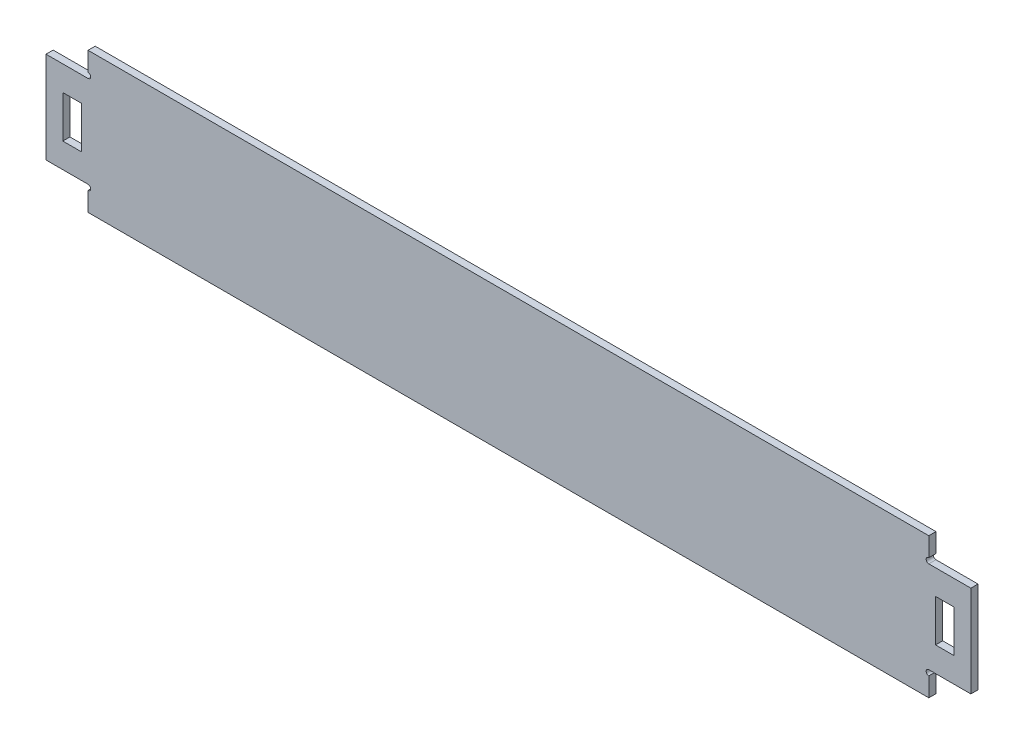
ISO-10303-21;
HEADER;
FILE_DESCRIPTION(('STEP AP214'),'2;1');
FILE_NAME('part.step','',(''),(''),'','','');
FILE_SCHEMA(('AUTOMOTIVE_DESIGN { 1 0 10303 214 1 1 1 1 }'));
ENDSEC;
DATA;
#1=APPLICATION_CONTEXT('core data for automotive mechanical design processes');
#2=APPLICATION_PROTOCOL_DEFINITION('international standard','automotive_design',2000,#1);
#3=PRODUCT_CONTEXT('',#1,'mechanical');
#4=PRODUCT('Part','Part','',(#3));
#5=PRODUCT_RELATED_PRODUCT_CATEGORY('part','',(#4));
#6=PRODUCT_DEFINITION_FORMATION('','',#4);
#7=PRODUCT_DEFINITION_CONTEXT('part definition',#1,'design');
#8=PRODUCT_DEFINITION('design','',#6,#7);
#9=PRODUCT_DEFINITION_SHAPE('','',#8);
#10=(LENGTH_UNIT() NAMED_UNIT(*) SI_UNIT(.MILLI.,.METRE.));
#11=(NAMED_UNIT(*) PLANE_ANGLE_UNIT() SI_UNIT($,.RADIAN.));
#12=(NAMED_UNIT(*) SI_UNIT($,.STERADIAN.) SOLID_ANGLE_UNIT());
#13=UNCERTAINTY_MEASURE_WITH_UNIT(LENGTH_MEASURE(1.E-05),#10,'distance_accuracy_value','');
#14=(GEOMETRIC_REPRESENTATION_CONTEXT(3) GLOBAL_UNCERTAINTY_ASSIGNED_CONTEXT((#13)) GLOBAL_UNIT_ASSIGNED_CONTEXT((#10,
#11,#12)) REPRESENTATION_CONTEXT('',''));
#15=CARTESIAN_POINT('',(0.,0.,0.));
#16=DIRECTION('',(0.,0.,1.));
#17=DIRECTION('',(1.,0.,0.));
#18=AXIS2_PLACEMENT_3D('',#15,#16,#17);
#19=CARTESIAN_POINT('',(0.,26.4687074829932,4.25));
#20=DIRECTION('',(0.,1.,0.));
#21=DIRECTION('',(0.,0.,1.));
#22=AXIS2_PLACEMENT_3D('',#19,#20,#21);
#23=PLANE('',#22);
#24=DIRECTION('',(1.,0.,0.));
#25=VECTOR('',#24,1.);
#26=CARTESIAN_POINT('',(0.,26.4687074829932,-4.25));
#27=LINE('',#26,#25);
#28=CARTESIAN_POINT('',(-528.569276331222,26.4687074829932,-4.25));
#29=VERTEX_POINT('',#28);
#30=CARTESIAN_POINT('',(-506.569276331222,26.4687074829932,-4.25));
#31=VERTEX_POINT('',#30);
#32=EDGE_CURVE('E953',#29,#31,#27,.T.);
#33=ORIENTED_EDGE('',*,*,#32,.T.);
#34=DIRECTION('',(0.,0.,-1.));
#35=VECTOR('',#34,1.);
#36=CARTESIAN_POINT('',(-506.569276331222,26.4687074829932,4.25));
#37=LINE('',#36,#35);
#38=CARTESIAN_POINT('',(-506.569276331222,26.4687074829932,4.25));
#39=VERTEX_POINT('',#38);
#40=EDGE_CURVE('E12',#39,#31,#37,.T.);
#41=ORIENTED_EDGE('',*,*,#40,.F.);
#42=DIRECTION('',(1.,0.,0.));
#43=VECTOR('',#42,1.);
#44=CARTESIAN_POINT('',(0.,26.4687074829932,4.25));
#45=LINE('',#44,#43);
#46=CARTESIAN_POINT('',(-528.569276331222,26.4687074829932,4.25));
#47=VERTEX_POINT('',#46);
#48=EDGE_CURVE('E222',#47,#39,#45,.T.);
#49=ORIENTED_EDGE('',*,*,#48,.F.);
#50=DIRECTION('',(0.,0.,-1.));
#51=VECTOR('',#50,1.);
#52=CARTESIAN_POINT('',(-528.569276331222,26.4687074829932,4.25));
#53=LINE('',#52,#51);
#54=EDGE_CURVE('E65',#47,#29,#53,.T.);
#55=ORIENTED_EDGE('',*,*,#54,.T.);
#56=EDGE_LOOP('',(#33,#41,#49,#55));
#57=FACE_BOUND('',#56,.T.);
#58=ADVANCED_FACE('F45',(#57),#23,.F.);
#59=CARTESIAN_POINT('',(-506.569276331222,0.,4.25));
#60=DIRECTION('',(1.,0.,0.));
#61=DIRECTION('',(0.,0.,-1.));
#62=AXIS2_PLACEMENT_3D('',#59,#60,#61);
#63=PLANE('',#62);
#64=DIRECTION('',(0.,-1.,0.));
#65=VECTOR('',#64,1.);
#66=CARTESIAN_POINT('',(-506.569276331222,0.,-4.25));
#67=LINE('',#66,#65);
#68=CARTESIAN_POINT('',(-506.569276331222,-23.5312925170068,-4.25));
#69=VERTEX_POINT('',#68);
#70=EDGE_CURVE('E229',#31,#69,#67,.T.);
#71=ORIENTED_EDGE('',*,*,#70,.T.);
#72=DIRECTION('',(0.,0.,-1.));
#73=VECTOR('',#72,1.);
#74=CARTESIAN_POINT('',(-506.569276331222,-23.5312925170068,4.25));
#75=LINE('',#74,#73);
#76=CARTESIAN_POINT('',(-506.569276331222,-23.5312925170068,4.25));
#77=VERTEX_POINT('',#76);
#78=EDGE_CURVE('E56',#77,#69,#75,.T.);
#79=ORIENTED_EDGE('',*,*,#78,.F.);
#80=DIRECTION('',(0.,-1.,0.));
#81=VECTOR('',#80,1.);
#82=CARTESIAN_POINT('',(-506.569276331222,0.,4.25));
#83=LINE('',#82,#81);
#84=EDGE_CURVE('E216',#39,#77,#83,.T.);
#85=ORIENTED_EDGE('',*,*,#84,.F.);
#86=ORIENTED_EDGE('',*,*,#40,.T.);
#87=EDGE_LOOP('',(#71,#79,#85,#86));
#88=FACE_BOUND('',#87,.T.);
#89=ADVANCED_FACE('F228',(#88),#63,.F.);
#90=CARTESIAN_POINT('',(0.,-23.5312925170068,4.25));
#91=DIRECTION('',(0.,1.,0.));
#92=DIRECTION('',(0.,0.,1.));
#93=AXIS2_PLACEMENT_3D('',#90,#91,#92);
#94=PLANE('',#93);
#95=DIRECTION('',(1.,0.,0.));
#96=VECTOR('',#95,1.);
#97=CARTESIAN_POINT('',(0.,-23.5312925170068,-4.25));
#98=LINE('',#97,#96);
#99=CARTESIAN_POINT('',(-528.569276331222,-23.5312925170068,-4.25));
#100=VERTEX_POINT('',#99);
#101=EDGE_CURVE('E276',#100,#69,#98,.T.);
#102=ORIENTED_EDGE('',*,*,#101,.F.);
#103=DIRECTION('',(0.,0.,-1.));
#104=VECTOR('',#103,1.);
#105=CARTESIAN_POINT('',(-528.569276331222,-23.5312925170068,4.25));
#106=LINE('',#105,#104);
#107=CARTESIAN_POINT('',(-528.569276331222,-23.5312925170068,4.25));
#108=VERTEX_POINT('',#107);
#109=EDGE_CURVE('E139',#108,#100,#106,.T.);
#110=ORIENTED_EDGE('',*,*,#109,.F.);
#111=DIRECTION('',(1.,0.,0.));
#112=VECTOR('',#111,1.);
#113=CARTESIAN_POINT('',(0.,-23.5312925170068,4.25));
#114=LINE('',#113,#112);
#115=EDGE_CURVE('E221',#108,#77,#114,.T.);
#116=ORIENTED_EDGE('',*,*,#115,.T.);
#117=ORIENTED_EDGE('',*,*,#78,.T.);
#118=EDGE_LOOP('',(#102,#110,#116,#117));
#119=FACE_BOUND('',#118,.T.);
#120=ADVANCED_FACE('F234',(#119),#94,.T.);
#121=CARTESIAN_POINT('',(0.,26.4687074829928,4.25));
#122=DIRECTION('',(0.,-1.,0.));
#123=DIRECTION('',(0.,0.,-1.));
#124=AXIS2_PLACEMENT_3D('',#121,#122,#123);
#125=PLANE('',#124);
#126=DIRECTION('',(-1.,0.,0.));
#127=VECTOR('',#126,1.);
#128=CARTESIAN_POINT('',(0.,26.4687074829928,-4.25));
#129=LINE('',#128,#127);
#130=CARTESIAN_POINT('',(531.430723668778,26.4687074829928,-4.25));
#131=VERTEX_POINT('',#130);
#132=CARTESIAN_POINT('',(509.430723668778,26.4687074829928,-4.25));
#133=VERTEX_POINT('',#132);
#134=EDGE_CURVE('E709',#131,#133,#129,.T.);
#135=ORIENTED_EDGE('',*,*,#134,.F.);
#136=DIRECTION('',(0.,0.,-1.));
#137=VECTOR('',#136,1.);
#138=CARTESIAN_POINT('',(531.430723668778,26.4687074829928,4.25));
#139=LINE('',#138,#137);
#140=CARTESIAN_POINT('',(531.430723668778,26.4687074829928,4.25));
#141=VERTEX_POINT('',#140);
#142=EDGE_CURVE('E283',#141,#131,#139,.T.);
#143=ORIENTED_EDGE('',*,*,#142,.F.);
#144=DIRECTION('',(-1.,0.,0.));
#145=VECTOR('',#144,1.);
#146=CARTESIAN_POINT('',(0.,26.4687074829928,4.25));
#147=LINE('',#146,#145);
#148=CARTESIAN_POINT('',(509.430723668778,26.4687074829928,4.25));
#149=VERTEX_POINT('',#148);
#150=EDGE_CURVE('E579',#141,#149,#147,.T.);
#151=ORIENTED_EDGE('',*,*,#150,.T.);
#152=DIRECTION('',(0.,0.,-1.));
#153=VECTOR('',#152,1.);
#154=CARTESIAN_POINT('',(509.430723668778,26.4687074829928,4.25));
#155=LINE('',#154,#153);
#156=EDGE_CURVE('E812',#149,#133,#155,.T.);
#157=ORIENTED_EDGE('',*,*,#156,.T.);
#158=EDGE_LOOP('',(#135,#143,#151,#157));
#159=FACE_BOUND('',#158,.T.);
#160=ADVANCED_FACE('F1008',(#159),#125,.T.);
#161=CARTESIAN_POINT('',(531.430723668778,0.,4.25));
#162=DIRECTION('',(1.,0.,0.));
#163=DIRECTION('',(0.,0.,-1.));
#164=AXIS2_PLACEMENT_3D('',#161,#162,#163);
#165=PLANE('',#164);
#166=DIRECTION('',(0.,-1.,0.));
#167=VECTOR('',#166,1.);
#168=CARTESIAN_POINT('',(531.430723668778,0.,-4.25));
#169=LINE('',#168,#167);
#170=CARTESIAN_POINT('',(531.430723668778,-23.5312925170072,-4.25));
#171=VERTEX_POINT('',#170);
#172=EDGE_CURVE('E934',#131,#171,#169,.T.);
#173=ORIENTED_EDGE('',*,*,#172,.T.);
#174=DIRECTION('',(0.,0.,-1.));
#175=VECTOR('',#174,1.);
#176=CARTESIAN_POINT('',(531.430723668778,-23.5312925170072,4.25));
#177=LINE('',#176,#175);
#178=CARTESIAN_POINT('',(531.430723668778,-23.5312925170072,4.25));
#179=VERTEX_POINT('',#178);
#180=EDGE_CURVE('E308',#179,#171,#177,.T.);
#181=ORIENTED_EDGE('',*,*,#180,.F.);
#182=DIRECTION('',(0.,-1.,0.));
#183=VECTOR('',#182,1.);
#184=CARTESIAN_POINT('',(531.430723668778,0.,4.25));
#185=LINE('',#184,#183);
#186=EDGE_CURVE('E960',#141,#179,#185,.T.);
#187=ORIENTED_EDGE('',*,*,#186,.F.);
#188=ORIENTED_EDGE('',*,*,#142,.T.);
#189=EDGE_LOOP('',(#173,#181,#187,#188));
#190=FACE_BOUND('',#189,.T.);
#191=ADVANCED_FACE('F1004',(#190),#165,.F.);
#192=CARTESIAN_POINT('',(0.,-23.5312925170069,4.25));
#193=DIRECTION('',(0.,-1.,0.));
#194=DIRECTION('',(1.,0.,0.));
#195=AXIS2_PLACEMENT_3D('',#192,#193,#194);
#196=PLANE('',#195);
#197=DIRECTION('',(-1.,0.,0.));
#198=VECTOR('',#197,1.);
#199=CARTESIAN_POINT('',(0.,-23.5312925170069,-4.25));
#200=LINE('',#199,#198);
#201=CARTESIAN_POINT('',(509.430723668778,-23.5312925170072,-4.25));
#202=VERTEX_POINT('',#201);
#203=EDGE_CURVE('E938',#171,#202,#200,.T.);
#204=ORIENTED_EDGE('',*,*,#203,.T.);
#205=DIRECTION('',(0.,0.,-1.));
#206=VECTOR('',#205,1.);
#207=CARTESIAN_POINT('',(509.430723668778,-23.5312925170072,4.25));
#208=LINE('',#207,#206);
#209=CARTESIAN_POINT('',(509.430723668778,-23.5312925170072,4.25));
#210=VERTEX_POINT('',#209);
#211=EDGE_CURVE('E809',#210,#202,#208,.T.);
#212=ORIENTED_EDGE('',*,*,#211,.F.);
#213=DIRECTION('',(-1.,0.,0.));
#214=VECTOR('',#213,1.);
#215=CARTESIAN_POINT('',(0.,-23.5312925170069,4.25));
#216=LINE('',#215,#214);
#217=EDGE_CURVE('E964',#179,#210,#216,.T.);
#218=ORIENTED_EDGE('',*,*,#217,.F.);
#219=ORIENTED_EDGE('',*,*,#180,.T.);
#220=EDGE_LOOP('',(#204,#212,#218,#219));
#221=FACE_BOUND('',#220,.T.);
#222=ADVANCED_FACE('F1001',(#221),#196,.F.);
#223=CARTESIAN_POINT('',(-498.569276331222,59.148707482993,4.25));
#224=DIRECTION('',(0.,0.,-1.));
#225=DIRECTION('',(-1.,0.,0.));
#226=AXIS2_PLACEMENT_3D('',#223,#224,#225);
#227=CYLINDRICAL_SURFACE('',#226,3.17999999999985);
#228=CARTESIAN_POINT('',(-498.569276331222,59.148707482993,-4.25));
#229=DIRECTION('',(0.,0.,1.));
#230=DIRECTION('',(1.,0.,0.));
#231=AXIS2_PLACEMENT_3D('',#228,#229,#230);
#232=CIRCLE('',#231,3.17999999999985);
#233=CARTESIAN_POINT('',(-498.569276331222,55.9687074829933,-4.25));
#234=VERTEX_POINT('',#233);
#235=CARTESIAN_POINT('',(-498.569276331222,62.328707482993,-4.25));
#236=VERTEX_POINT('',#235);
#237=EDGE_CURVE('E608',#234,#236,#232,.T.);
#238=ORIENTED_EDGE('',*,*,#237,.F.);
#239=DIRECTION('',(0.,0.,-1.));
#240=VECTOR('',#239,1.);
#241=CARTESIAN_POINT('',(-498.569276331222,55.9687074829933,4.25));
#242=LINE('',#241,#240);
#243=CARTESIAN_POINT('',(-498.569276331222,55.9687074829933,4.25));
#244=VERTEX_POINT('',#243);
#245=EDGE_CURVE('E49',#244,#234,#242,.T.);
#246=ORIENTED_EDGE('',*,*,#245,.F.);
#247=CARTESIAN_POINT('',(-498.569276331222,59.148707482993,4.25));
#248=DIRECTION('',(0.,0.,1.));
#249=DIRECTION('',(1.,0.,0.));
#250=AXIS2_PLACEMENT_3D('',#247,#248,#249);
#251=CIRCLE('',#250,3.17999999999985);
#252=CARTESIAN_POINT('',(-498.569276331222,62.328707482993,4.25));
#253=VERTEX_POINT('',#252);
#254=EDGE_CURVE('E275',#244,#253,#251,.T.);
#255=ORIENTED_EDGE('',*,*,#254,.T.);
#256=DIRECTION('',(0.,0.,-1.));
#257=VECTOR('',#256,1.);
#258=CARTESIAN_POINT('',(-498.569276331222,62.328707482993,4.25));
#259=LINE('',#258,#257);
#260=EDGE_CURVE('E240',#253,#236,#259,.T.);
#261=ORIENTED_EDGE('',*,*,#260,.T.);
#262=EDGE_LOOP('',(#238,#246,#255,#261));
#263=FACE_BOUND('',#262,.T.);
#264=ADVANCED_FACE('F47',(#263),#227,.F.);
#265=CARTESIAN_POINT('',(-1.32042713875528E-13,55.9687074829945,4.25));
#266=DIRECTION('',(0.,1.,0.));
#267=DIRECTION('',(-1.,0.,0.));
#268=AXIS2_PLACEMENT_3D('',#265,#266,#267);
#269=PLANE('',#268);
#270=DIRECTION('',(1.,0.,0.));
#271=VECTOR('',#270,1.);
#272=CARTESIAN_POINT('',(-1.32042713875528E-13,55.9687074829945,-4.25));
#273=LINE('',#272,#271);
#274=CARTESIAN_POINT('',(-548.569276331222,55.9687074829932,-4.25));
#275=VERTEX_POINT('',#274);
#276=EDGE_CURVE('E612',#275,#234,#273,.T.);
#277=ORIENTED_EDGE('',*,*,#276,.F.);
#278=DIRECTION('',(0.,0.,-1.));
#279=VECTOR('',#278,1.);
#280=CARTESIAN_POINT('',(-548.569276331222,55.9687074829932,4.25));
#281=LINE('',#280,#279);
#282=CARTESIAN_POINT('',(-548.569276331222,55.9687074829932,4.25));
#283=VERTEX_POINT('',#282);
#284=EDGE_CURVE('E334',#283,#275,#281,.T.);
#285=ORIENTED_EDGE('',*,*,#284,.F.);
#286=DIRECTION('',(1.,0.,0.));
#287=VECTOR('',#286,1.);
#288=CARTESIAN_POINT('',(-1.32042713875528E-13,55.9687074829945,4.25));
#289=LINE('',#288,#287);
#290=EDGE_CURVE('E827',#283,#244,#289,.T.);
#291=ORIENTED_EDGE('',*,*,#290,.T.);
#292=ORIENTED_EDGE('',*,*,#245,.T.);
#293=EDGE_LOOP('',(#277,#285,#291,#292));
#294=FACE_BOUND('',#293,.T.);
#295=ADVANCED_FACE('F825',(#294),#269,.T.);
#296=CARTESIAN_POINT('',(-548.569276331222,0.,4.25));
#297=DIRECTION('',(1.,0.,0.));
#298=DIRECTION('',(0.,0.,-1.));
#299=AXIS2_PLACEMENT_3D('',#296,#297,#298);
#300=PLANE('',#299);
#301=DIRECTION('',(0.,-1.,0.));
#302=VECTOR('',#301,1.);
#303=CARTESIAN_POINT('',(-548.569276331222,0.,-4.25));
#304=LINE('',#303,#302);
#305=CARTESIAN_POINT('',(-548.569276331222,-53.0312925170068,-4.25));
#306=VERTEX_POINT('',#305);
#307=EDGE_CURVE('E617',#275,#306,#304,.T.);
#308=ORIENTED_EDGE('',*,*,#307,.T.);
#309=DIRECTION('',(0.,0.,-1.));
#310=VECTOR('',#309,1.);
#311=CARTESIAN_POINT('',(-548.569276331222,-53.0312925170068,4.25));
#312=LINE('',#311,#310);
#313=CARTESIAN_POINT('',(-548.569276331222,-53.0312925170068,4.25));
#314=VERTEX_POINT('',#313);
#315=EDGE_CURVE('E338',#314,#306,#312,.T.);
#316=ORIENTED_EDGE('',*,*,#315,.F.);
#317=DIRECTION('',(0.,-1.,0.));
#318=VECTOR('',#317,1.);
#319=CARTESIAN_POINT('',(-548.569276331222,0.,4.25));
#320=LINE('',#319,#318);
#321=EDGE_CURVE('E847',#283,#314,#320,.T.);
#322=ORIENTED_EDGE('',*,*,#321,.F.);
#323=ORIENTED_EDGE('',*,*,#284,.T.);
#324=EDGE_LOOP('',(#308,#316,#322,#323));
#325=FACE_BOUND('',#324,.T.);
#326=ADVANCED_FACE('F836',(#325),#300,.F.);
#327=CARTESIAN_POINT('',(-1.2511269420328E-13,-53.0312925170081,4.25));
#328=DIRECTION('',(0.,1.,0.));
#329=DIRECTION('',(-1.,0.,0.));
#330=AXIS2_PLACEMENT_3D('',#327,#328,#329);
#331=PLANE('',#330);
#332=DIRECTION('',(1.,0.,0.));
#333=VECTOR('',#332,1.);
#334=CARTESIAN_POINT('',(-1.2511269420328E-13,-53.0312925170081,-4.25));
#335=LINE('',#334,#333);
#336=CARTESIAN_POINT('',(-498.569276331222,-53.0312925170069,-4.25));
#337=VERTEX_POINT('',#336);
#338=EDGE_CURVE('E624',#306,#337,#335,.T.);
#339=ORIENTED_EDGE('',*,*,#338,.T.);
#340=DIRECTION('',(0.,0.,-1.));
#341=VECTOR('',#340,1.);
#342=CARTESIAN_POINT('',(-498.569276331222,-53.0312925170069,4.25));
#343=LINE('',#342,#341);
#344=CARTESIAN_POINT('',(-498.569276331222,-53.0312925170069,4.25));
#345=VERTEX_POINT('',#344);
#346=EDGE_CURVE('E342',#345,#337,#343,.T.);
#347=ORIENTED_EDGE('',*,*,#346,.F.);
#348=DIRECTION('',(1.,0.,0.));
#349=VECTOR('',#348,1.);
#350=CARTESIAN_POINT('',(-1.2511269420328E-13,-53.0312925170081,4.25));
#351=LINE('',#350,#349);
#352=EDGE_CURVE('E842',#314,#345,#351,.T.);
#353=ORIENTED_EDGE('',*,*,#352,.F.);
#354=ORIENTED_EDGE('',*,*,#315,.T.);
#355=EDGE_LOOP('',(#339,#347,#353,#354));
#356=FACE_BOUND('',#355,.T.);
#357=ADVANCED_FACE('F840',(#356),#331,.F.);
#358=CARTESIAN_POINT('',(-498.569276331222,-56.211292517007,4.25));
#359=DIRECTION('',(0.,0.,-1.));
#360=DIRECTION('',(-1.,0.,0.));
#361=AXIS2_PLACEMENT_3D('',#358,#359,#360);
#362=CYLINDRICAL_SURFACE('',#361,3.17999999999985);
#363=CARTESIAN_POINT('',(-498.569276331222,-56.211292517007,-4.25));
#364=DIRECTION('',(0.,0.,1.));
#365=DIRECTION('',(1.,0.,0.));
#366=AXIS2_PLACEMENT_3D('',#363,#364,#365);
#367=CIRCLE('',#366,3.17999999999985);
#368=CARTESIAN_POINT('',(-498.569276331222,-59.3912925170066,-4.25));
#369=VERTEX_POINT('',#368);
#370=EDGE_CURVE('E628',#337,#369,#367,.F.);
#371=ORIENTED_EDGE('',*,*,#370,.T.);
#372=DIRECTION('',(0.,0.,-1.));
#373=VECTOR('',#372,1.);
#374=CARTESIAN_POINT('',(-498.569276331222,-59.3912925170066,4.25));
#375=LINE('',#374,#373);
#376=CARTESIAN_POINT('',(-498.569276331222,-59.3912925170066,4.25));
#377=VERTEX_POINT('',#376);
#378=EDGE_CURVE('E345',#377,#369,#375,.T.);
#379=ORIENTED_EDGE('',*,*,#378,.F.);
#380=CARTESIAN_POINT('',(-498.569276331222,-56.211292517007,4.25));
#381=DIRECTION('',(0.,0.,1.));
#382=DIRECTION('',(1.,0.,0.));
#383=AXIS2_PLACEMENT_3D('',#380,#381,#382);
#384=CIRCLE('',#383,3.17999999999985);
#385=EDGE_CURVE('E846',#345,#377,#384,.F.);
#386=ORIENTED_EDGE('',*,*,#385,.F.);
#387=ORIENTED_EDGE('',*,*,#346,.T.);
#388=EDGE_LOOP('',(#371,#379,#386,#387));
#389=FACE_BOUND('',#388,.T.);
#390=ADVANCED_FACE('F1039',(#389),#362,.F.);
#391=CARTESIAN_POINT('',(-498.569276331222,1.22244498664669E-12,4.25));
#392=DIRECTION('',(1.,0.,0.));
#393=DIRECTION('',(0.,1.,0.));
#394=AXIS2_PLACEMENT_3D('',#391,#392,#393);
#395=PLANE('',#394);
#396=DIRECTION('',(0.,-1.,0.));
#397=VECTOR('',#396,1.);
#398=CARTESIAN_POINT('',(-498.569276331222,1.22244498664669E-12,-4.25));
#399=LINE('',#398,#397);
#400=CARTESIAN_POINT('',(-498.569276331222,-82.0312925170068,-4.25));
#401=VERTEX_POINT('',#400);
#402=EDGE_CURVE('E683',#369,#401,#399,.T.);
#403=ORIENTED_EDGE('',*,*,#402,.T.);
#404=DIRECTION('',(0.,0.,-1.));
#405=VECTOR('',#404,1.);
#406=CARTESIAN_POINT('',(-498.569276331222,-82.0312925170068,4.25));
#407=LINE('',#406,#405);
#408=CARTESIAN_POINT('',(-498.569276331222,-82.0312925170068,4.25));
#409=VERTEX_POINT('',#408);
#410=EDGE_CURVE('E350',#409,#401,#407,.T.);
#411=ORIENTED_EDGE('',*,*,#410,.F.);
#412=DIRECTION('',(0.,-1.,0.));
#413=VECTOR('',#412,1.);
#414=CARTESIAN_POINT('',(-498.569276331222,1.22244498664669E-12,4.25));
#415=LINE('',#414,#413);
#416=EDGE_CURVE('E851',#377,#409,#415,.T.);
#417=ORIENTED_EDGE('',*,*,#416,.F.);
#418=ORIENTED_EDGE('',*,*,#378,.T.);
#419=EDGE_LOOP('',(#403,#411,#417,#418));
#420=FACE_BOUND('',#419,.T.);
#421=ADVANCED_FACE('F1036',(#420),#395,.F.);
#422=CARTESIAN_POINT('',(0.,-82.0312925170068,4.25));
#423=DIRECTION('',(0.,1.,0.));
#424=DIRECTION('',(0.,0.,1.));
#425=AXIS2_PLACEMENT_3D('',#422,#423,#424);
#426=PLANE('',#425);
#427=DIRECTION('',(1.,0.,0.));
#428=VECTOR('',#427,1.);
#429=CARTESIAN_POINT('',(0.,-82.0312925170068,-4.25));
#430=LINE('',#429,#428);
#431=CARTESIAN_POINT('',(501.430723668778,-82.0312925170068,-4.25));
#432=VERTEX_POINT('',#431);
#433=EDGE_CURVE('E680',#401,#432,#430,.T.);
#434=ORIENTED_EDGE('',*,*,#433,.T.);
#435=DIRECTION('',(0.,0.,-1.));
#436=VECTOR('',#435,1.);
#437=CARTESIAN_POINT('',(501.430723668778,-82.0312925170068,4.25));
#438=LINE('',#437,#436);
#439=CARTESIAN_POINT('',(501.430723668778,-82.0312925170068,4.25));
#440=VERTEX_POINT('',#439);
#441=EDGE_CURVE('E354',#440,#432,#438,.T.);
#442=ORIENTED_EDGE('',*,*,#441,.F.);
#443=DIRECTION('',(1.,0.,0.));
#444=VECTOR('',#443,1.);
#445=CARTESIAN_POINT('',(0.,-82.0312925170068,4.25));
#446=LINE('',#445,#444);
#447=EDGE_CURVE('E872',#409,#440,#446,.T.);
#448=ORIENTED_EDGE('',*,*,#447,.F.);
#449=ORIENTED_EDGE('',*,*,#410,.T.);
#450=EDGE_LOOP('',(#434,#442,#448,#449));
#451=FACE_BOUND('',#450,.T.);
#452=ADVANCED_FACE('F1033',(#451),#426,.F.);
#453=CARTESIAN_POINT('',(501.430723668778,0.,4.25));
#454=DIRECTION('',(1.,0.,0.));
#455=DIRECTION('',(0.,0.,-1.));
#456=AXIS2_PLACEMENT_3D('',#453,#454,#455);
#457=PLANE('',#456);
#458=DIRECTION('',(0.,-1.,0.));
#459=VECTOR('',#458,1.);
#460=CARTESIAN_POINT('',(501.430723668778,0.,-4.25));
#461=LINE('',#460,#459);
#462=CARTESIAN_POINT('',(501.430723668778,-59.3912925170068,-4.25));
#463=VERTEX_POINT('',#462);
#464=EDGE_CURVE('E639',#463,#432,#461,.T.);
#465=ORIENTED_EDGE('',*,*,#464,.F.);
#466=DIRECTION('',(0.,0.,-1.));
#467=VECTOR('',#466,1.);
#468=CARTESIAN_POINT('',(501.430723668778,-59.3912925170068,4.25));
#469=LINE('',#468,#467);
#470=CARTESIAN_POINT('',(501.430723668778,-59.3912925170068,4.25));
#471=VERTEX_POINT('',#470);
#472=EDGE_CURVE('E357',#471,#463,#469,.T.);
#473=ORIENTED_EDGE('',*,*,#472,.F.);
#474=DIRECTION('',(0.,-1.,0.));
#475=VECTOR('',#474,1.);
#476=CARTESIAN_POINT('',(501.430723668778,0.,4.25));
#477=LINE('',#476,#475);
#478=EDGE_CURVE('E881',#471,#440,#477,.T.);
#479=ORIENTED_EDGE('',*,*,#478,.T.);
#480=ORIENTED_EDGE('',*,*,#441,.T.);
#481=EDGE_LOOP('',(#465,#473,#479,#480));
#482=FACE_BOUND('',#481,.T.);
#483=ADVANCED_FACE('F1030',(#482),#457,.T.);
#484=CARTESIAN_POINT('',(501.430723668778,-56.2112925170068,4.25));
#485=DIRECTION('',(0.,0.,-1.));
#486=DIRECTION('',(-1.,0.,0.));
#487=AXIS2_PLACEMENT_3D('',#484,#485,#486);
#488=CYLINDRICAL_SURFACE('',#487,3.17999999999974);
#489=CARTESIAN_POINT('',(501.430723668778,-56.2112925170068,-4.25));
#490=DIRECTION('',(0.,0.,1.));
#491=DIRECTION('',(1.,0.,0.));
#492=AXIS2_PLACEMENT_3D('',#489,#490,#491);
#493=CIRCLE('',#492,3.17999999999974);
#494=CARTESIAN_POINT('',(501.430723668778,-53.0312925170073,-4.25));
#495=VERTEX_POINT('',#494);
#496=EDGE_CURVE('E633',#495,#463,#493,.T.);
#497=ORIENTED_EDGE('',*,*,#496,.F.);
#498=DIRECTION('',(0.,0.,-1.));
#499=VECTOR('',#498,1.);
#500=CARTESIAN_POINT('',(501.430723668778,-53.0312925170073,4.25));
#501=LINE('',#500,#499);
#502=CARTESIAN_POINT('',(501.430723668778,-53.0312925170073,4.25));
#503=VERTEX_POINT('',#502);
#504=EDGE_CURVE('E360',#503,#495,#501,.T.);
#505=ORIENTED_EDGE('',*,*,#504,.F.);
#506=CARTESIAN_POINT('',(501.430723668778,-56.2112925170068,4.25));
#507=DIRECTION('',(0.,0.,1.));
#508=DIRECTION('',(1.,0.,0.));
#509=AXIS2_PLACEMENT_3D('',#506,#507,#508);
#510=CIRCLE('',#509,3.17999999999974);
#511=EDGE_CURVE('E885',#503,#471,#510,.T.);
#512=ORIENTED_EDGE('',*,*,#511,.T.);
#513=ORIENTED_EDGE('',*,*,#472,.T.);
#514=EDGE_LOOP('',(#497,#505,#512,#513));
#515=FACE_BOUND('',#514,.T.);
#516=ADVANCED_FACE('F674',(#515),#488,.F.);
#517=CARTESIAN_POINT('',(0.,-53.0312925170081,4.25));
#518=DIRECTION('',(0.,-1.,0.));
#519=DIRECTION('',(1.,0.,0.));
#520=AXIS2_PLACEMENT_3D('',#517,#518,#519);
#521=PLANE('',#520);
#522=DIRECTION('',(-1.,0.,0.));
#523=VECTOR('',#522,1.);
#524=CARTESIAN_POINT('',(0.,-53.0312925170081,-4.25));
#525=LINE('',#524,#523);
#526=CARTESIAN_POINT('',(551.430723668778,-53.0312925170072,-4.25));
#527=VERTEX_POINT('',#526);
#528=EDGE_CURVE('E638',#527,#495,#525,.T.);
#529=ORIENTED_EDGE('',*,*,#528,.F.);
#530=DIRECTION('',(0.,0.,-1.));
#531=VECTOR('',#530,1.);
#532=CARTESIAN_POINT('',(551.430723668778,-53.0312925170072,4.25));
#533=LINE('',#532,#531);
#534=CARTESIAN_POINT('',(551.430723668778,-53.0312925170072,4.25));
#535=VERTEX_POINT('',#534);
#536=EDGE_CURVE('E363',#535,#527,#533,.T.);
#537=ORIENTED_EDGE('',*,*,#536,.F.);
#538=DIRECTION('',(-1.,0.,0.));
#539=VECTOR('',#538,1.);
#540=CARTESIAN_POINT('',(0.,-53.0312925170081,4.25));
#541=LINE('',#540,#539);
#542=EDGE_CURVE('E670',#535,#503,#541,.T.);
#543=ORIENTED_EDGE('',*,*,#542,.T.);
#544=ORIENTED_EDGE('',*,*,#504,.T.);
#545=EDGE_LOOP('',(#529,#537,#543,#544));
#546=FACE_BOUND('',#545,.T.);
#547=ADVANCED_FACE('F668',(#546),#521,.T.);
#548=CARTESIAN_POINT('',(551.430723668778,0.,4.25));
#549=DIRECTION('',(1.,0.,0.));
#550=DIRECTION('',(0.,0.,-1.));
#551=AXIS2_PLACEMENT_3D('',#548,#549,#550);
#552=PLANE('',#551);
#553=DIRECTION('',(0.,-1.,0.));
#554=VECTOR('',#553,1.);
#555=CARTESIAN_POINT('',(551.430723668778,0.,-4.25));
#556=LINE('',#555,#554);
#557=CARTESIAN_POINT('',(551.430723668778,55.9687074829928,-4.25));
#558=VERTEX_POINT('',#557);
#559=EDGE_CURVE('E599',#558,#527,#556,.T.);
#560=ORIENTED_EDGE('',*,*,#559,.F.);
#561=DIRECTION('',(0.,0.,-1.));
#562=VECTOR('',#561,1.);
#563=CARTESIAN_POINT('',(551.430723668778,55.9687074829928,4.25));
#564=LINE('',#563,#562);
#565=CARTESIAN_POINT('',(551.430723668778,55.9687074829928,4.25));
#566=VERTEX_POINT('',#565);
#567=EDGE_CURVE('E366',#566,#558,#564,.T.);
#568=ORIENTED_EDGE('',*,*,#567,.F.);
#569=DIRECTION('',(0.,-1.,0.));
#570=VECTOR('',#569,1.);
#571=CARTESIAN_POINT('',(551.430723668778,0.,4.25));
#572=LINE('',#571,#570);
#573=EDGE_CURVE('E664',#566,#535,#572,.T.);
#574=ORIENTED_EDGE('',*,*,#573,.T.);
#575=ORIENTED_EDGE('',*,*,#536,.T.);
#576=EDGE_LOOP('',(#560,#568,#574,#575));
#577=FACE_BOUND('',#576,.T.);
#578=ADVANCED_FACE('F660',(#577),#552,.T.);
#579=CARTESIAN_POINT('',(1.94180461581659E-13,55.9687074829947,4.25));
#580=DIRECTION('',(0.,-1.,0.));
#581=DIRECTION('',(1.,0.,0.));
#582=AXIS2_PLACEMENT_3D('',#579,#580,#581);
#583=PLANE('',#582);
#584=DIRECTION('',(-1.,0.,0.));
#585=VECTOR('',#584,1.);
#586=CARTESIAN_POINT('',(1.94180461581659E-13,55.9687074829947,-4.25));
#587=LINE('',#586,#585);
#588=CARTESIAN_POINT('',(501.430723668778,55.9687074829929,-4.25));
#589=VERTEX_POINT('',#588);
#590=EDGE_CURVE('E593',#558,#589,#587,.T.);
#591=ORIENTED_EDGE('',*,*,#590,.T.);
#592=DIRECTION('',(0.,0.,-1.));
#593=VECTOR('',#592,1.);
#594=CARTESIAN_POINT('',(501.430723668778,55.9687074829929,4.25));
#595=LINE('',#594,#593);
#596=CARTESIAN_POINT('',(501.430723668778,55.9687074829929,4.25));
#597=VERTEX_POINT('',#596);
#598=EDGE_CURVE('E324',#597,#589,#595,.T.);
#599=ORIENTED_EDGE('',*,*,#598,.F.);
#600=DIRECTION('',(-1.,0.,0.));
#601=VECTOR('',#600,1.);
#602=CARTESIAN_POINT('',(1.94180461581659E-13,55.9687074829947,4.25));
#603=LINE('',#602,#601);
#604=EDGE_CURVE('E900',#566,#597,#603,.T.);
#605=ORIENTED_EDGE('',*,*,#604,.F.);
#606=ORIENTED_EDGE('',*,*,#567,.T.);
#607=EDGE_LOOP('',(#591,#599,#605,#606));
#608=FACE_BOUND('',#607,.T.);
#609=ADVANCED_FACE('F1019',(#608),#583,.F.);
#610=CARTESIAN_POINT('',(501.430723668778,59.1487074829932,4.25));
#611=DIRECTION('',(0.,0.,-1.));
#612=DIRECTION('',(-1.,0.,0.));
#613=AXIS2_PLACEMENT_3D('',#610,#611,#612);
#614=CYLINDRICAL_SURFACE('',#613,3.18000000000013);
#615=CARTESIAN_POINT('',(501.430723668778,59.1487074829932,-4.25));
#616=DIRECTION('',(0.,0.,1.));
#617=DIRECTION('',(1.,0.,0.));
#618=AXIS2_PLACEMENT_3D('',#615,#616,#617);
#619=CIRCLE('',#618,3.18000000000013);
#620=CARTESIAN_POINT('',(501.430723668778,62.3287074829932,-4.25));
#621=VERTEX_POINT('',#620);
#622=EDGE_CURVE('E598',#589,#621,#619,.F.);
#623=ORIENTED_EDGE('',*,*,#622,.T.);
#624=DIRECTION('',(0.,0.,-1.));
#625=VECTOR('',#624,1.);
#626=CARTESIAN_POINT('',(501.430723668778,62.3287074829932,4.25));
#627=LINE('',#626,#625);
#628=CARTESIAN_POINT('',(501.430723668778,62.3287074829932,4.25));
#629=VERTEX_POINT('',#628);
#630=EDGE_CURVE('E320',#629,#621,#627,.T.);
#631=ORIENTED_EDGE('',*,*,#630,.F.);
#632=CARTESIAN_POINT('',(501.430723668778,59.1487074829932,4.25));
#633=DIRECTION('',(0.,0.,1.));
#634=DIRECTION('',(1.,0.,0.));
#635=AXIS2_PLACEMENT_3D('',#632,#633,#634);
#636=CIRCLE('',#635,3.18000000000013);
#637=EDGE_CURVE('E903',#597,#629,#636,.F.);
#638=ORIENTED_EDGE('',*,*,#637,.F.);
#639=ORIENTED_EDGE('',*,*,#598,.T.);
#640=EDGE_LOOP('',(#623,#631,#638,#639));
#641=FACE_BOUND('',#640,.T.);
#642=ADVANCED_FACE('F1016',(#641),#614,.F.);
#643=CARTESIAN_POINT('',(501.430723668778,0.,4.25));
#644=DIRECTION('',(1.,0.,0.));
#645=DIRECTION('',(0.,0.,-1.));
#646=AXIS2_PLACEMENT_3D('',#643,#644,#645);
#647=PLANE('',#646);
#648=DIRECTION('',(0.,-1.,0.));
#649=VECTOR('',#648,1.);
#650=CARTESIAN_POINT('',(501.430723668778,0.,-4.25));
#651=LINE('',#650,#649);
#652=CARTESIAN_POINT('',(501.430723668778,84.9687074829932,-4.25));
#653=VERTEX_POINT('',#652);
#654=EDGE_CURVE('E696',#653,#621,#651,.T.);
#655=ORIENTED_EDGE('',*,*,#654,.F.);
#656=DIRECTION('',(0.,0.,-1.));
#657=VECTOR('',#656,1.);
#658=CARTESIAN_POINT('',(501.430723668778,84.9687074829932,4.25));
#659=LINE('',#658,#657);
#660=CARTESIAN_POINT('',(501.430723668778,84.9687074829932,4.25));
#661=VERTEX_POINT('',#660);
#662=EDGE_CURVE('E317',#661,#653,#659,.T.);
#663=ORIENTED_EDGE('',*,*,#662,.F.);
#664=DIRECTION('',(0.,-1.,0.));
#665=VECTOR('',#664,1.);
#666=CARTESIAN_POINT('',(501.430723668778,0.,4.25));
#667=LINE('',#666,#665);
#668=EDGE_CURVE('E475',#661,#629,#667,.T.);
#669=ORIENTED_EDGE('',*,*,#668,.T.);
#670=ORIENTED_EDGE('',*,*,#630,.T.);
#671=EDGE_LOOP('',(#655,#663,#669,#670));
#672=FACE_BOUND('',#671,.T.);
#673=ADVANCED_FACE('F913',(#672),#647,.T.);
#674=CARTESIAN_POINT('',(0.,84.9687074829932,4.25));
#675=DIRECTION('',(0.,1.,0.));
#676=DIRECTION('',(0.,0.,1.));
#677=AXIS2_PLACEMENT_3D('',#674,#675,#676);
#678=PLANE('',#677);
#679=DIRECTION('',(1.,0.,0.));
#680=VECTOR('',#679,1.);
#681=CARTESIAN_POINT('',(0.,84.9687074829932,-4.25));
#682=LINE('',#681,#680);
#683=CARTESIAN_POINT('',(-498.569276331222,84.9687074829932,-4.25));
#684=VERTEX_POINT('',#683);
#685=EDGE_CURVE('E699',#684,#653,#682,.T.);
#686=ORIENTED_EDGE('',*,*,#685,.F.);
#687=DIRECTION('',(0.,0.,-1.));
#688=VECTOR('',#687,1.);
#689=CARTESIAN_POINT('',(-498.569276331222,84.9687074829932,4.25));
#690=LINE('',#689,#688);
#691=CARTESIAN_POINT('',(-498.569276331222,84.9687074829932,4.25));
#692=VERTEX_POINT('',#691);
#693=EDGE_CURVE('E314',#692,#684,#690,.T.);
#694=ORIENTED_EDGE('',*,*,#693,.F.);
#695=DIRECTION('',(1.,0.,0.));
#696=VECTOR('',#695,1.);
#697=CARTESIAN_POINT('',(0.,84.9687074829932,4.25));
#698=LINE('',#697,#696);
#699=EDGE_CURVE('E468',#692,#661,#698,.T.);
#700=ORIENTED_EDGE('',*,*,#699,.T.);
#701=ORIENTED_EDGE('',*,*,#662,.T.);
#702=EDGE_LOOP('',(#686,#694,#700,#701));
#703=FACE_BOUND('',#702,.T.);
#704=ADVANCED_FACE('F919',(#703),#678,.T.);
#705=CARTESIAN_POINT('',(509.430723668778,0.,4.25));
#706=DIRECTION('',(1.,0.,0.));
#707=DIRECTION('',(0.,0.,-1.));
#708=AXIS2_PLACEMENT_3D('',#705,#706,#707);
#709=PLANE('',#708);
#710=DIRECTION('',(0.,-1.,0.));
#711=VECTOR('',#710,1.);
#712=CARTESIAN_POINT('',(509.430723668778,0.,-4.25));
#713=LINE('',#712,#711);
#714=EDGE_CURVE('E948',#133,#202,#713,.T.);
#715=ORIENTED_EDGE('',*,*,#714,.F.);
#716=ORIENTED_EDGE('',*,*,#156,.F.);
#717=DIRECTION('',(0.,-1.,0.));
#718=VECTOR('',#717,1.);
#719=CARTESIAN_POINT('',(509.430723668778,0.,4.25));
#720=LINE('',#719,#718);
#721=EDGE_CURVE('E262',#149,#210,#720,.T.);
#722=ORIENTED_EDGE('',*,*,#721,.T.);
#723=ORIENTED_EDGE('',*,*,#211,.T.);
#724=EDGE_LOOP('',(#715,#716,#722,#723));
#725=FACE_BOUND('',#724,.T.);
#726=ADVANCED_FACE('F987',(#725),#709,.T.);
#727=CARTESIAN_POINT('',(-498.569276331222,-1.22244498664669E-12,4.25));
#728=DIRECTION('',(1.,0.,0.));
#729=DIRECTION('',(0.,1.,0.));
#730=AXIS2_PLACEMENT_3D('',#727,#728,#729);
#731=PLANE('',#730);
#732=DIRECTION('',(0.,-1.,0.));
#733=VECTOR('',#732,1.);
#734=CARTESIAN_POINT('',(-498.569276331222,-1.22244498664669E-12,-4.25));
#735=LINE('',#734,#733);
#736=EDGE_CURVE('E704',#684,#236,#735,.T.);
#737=ORIENTED_EDGE('',*,*,#736,.T.);
#738=ORIENTED_EDGE('',*,*,#260,.F.);
#739=DIRECTION('',(0.,-1.,0.));
#740=VECTOR('',#739,1.);
#741=CARTESIAN_POINT('',(-498.569276331222,-1.22244498664669E-12,4.25));
#742=LINE('',#741,#740);
#743=EDGE_CURVE('E474',#692,#253,#742,.T.);
#744=ORIENTED_EDGE('',*,*,#743,.F.);
#745=ORIENTED_EDGE('',*,*,#693,.T.);
#746=EDGE_LOOP('',(#737,#738,#744,#745));
#747=FACE_BOUND('',#746,.T.);
#748=ADVANCED_FACE('F922',(#747),#731,.F.);
#749=CARTESIAN_POINT('',(-528.569276331222,0.,4.25));
#750=DIRECTION('',(1.,0.,0.));
#751=DIRECTION('',(0.,0.,-1.));
#752=AXIS2_PLACEMENT_3D('',#749,#750,#751);
#753=PLANE('',#752);
#754=DIRECTION('',(0.,-1.,0.));
#755=VECTOR('',#754,1.);
#756=CARTESIAN_POINT('',(-528.569276331222,0.,-4.25));
#757=LINE('',#756,#755);
#758=EDGE_CURVE('E271',#29,#100,#757,.T.);
#759=ORIENTED_EDGE('',*,*,#758,.F.);
#760=ORIENTED_EDGE('',*,*,#54,.F.);
#761=DIRECTION('',(0.,-1.,0.));
#762=VECTOR('',#761,1.);
#763=CARTESIAN_POINT('',(-528.569276331222,0.,4.25));
#764=LINE('',#763,#762);
#765=EDGE_CURVE('E236',#47,#108,#764,.T.);
#766=ORIENTED_EDGE('',*,*,#765,.T.);
#767=ORIENTED_EDGE('',*,*,#109,.T.);
#768=EDGE_LOOP('',(#759,#760,#766,#767));
#769=FACE_BOUND('',#768,.T.);
#770=ADVANCED_FACE('F979',(#769),#753,.T.);
#771=CARTESIAN_POINT('',(0.,0.,4.25));
#772=DIRECTION('',(0.,0.,1.));
#773=DIRECTION('',(1.,0.,0.));
#774=AXIS2_PLACEMENT_3D('',#771,#772,#773);
#775=PLANE('',#774);
#776=ORIENTED_EDGE('',*,*,#254,.F.);
#777=ORIENTED_EDGE('',*,*,#290,.F.);
#778=ORIENTED_EDGE('',*,*,#321,.T.);
#779=ORIENTED_EDGE('',*,*,#352,.T.);
#780=ORIENTED_EDGE('',*,*,#385,.T.);
#781=ORIENTED_EDGE('',*,*,#416,.T.);
#782=ORIENTED_EDGE('',*,*,#447,.T.);
#783=ORIENTED_EDGE('',*,*,#478,.F.);
#784=ORIENTED_EDGE('',*,*,#511,.F.);
#785=ORIENTED_EDGE('',*,*,#542,.F.);
#786=ORIENTED_EDGE('',*,*,#573,.F.);
#787=ORIENTED_EDGE('',*,*,#604,.T.);
#788=ORIENTED_EDGE('',*,*,#637,.T.);
#789=ORIENTED_EDGE('',*,*,#668,.F.);
#790=ORIENTED_EDGE('',*,*,#699,.F.);
#791=ORIENTED_EDGE('',*,*,#743,.T.);
#792=EDGE_LOOP('',(#776,#777,#778,#779,#780,#781,#782,#783,#784,#785,#786,#787,#788,#789,#790,#791));
#793=FACE_BOUND('',#792,.T.);
#794=ORIENTED_EDGE('',*,*,#150,.F.);
#795=ORIENTED_EDGE('',*,*,#186,.T.);
#796=ORIENTED_EDGE('',*,*,#217,.T.);
#797=ORIENTED_EDGE('',*,*,#721,.F.);
#798=EDGE_LOOP('',(#794,#795,#796,#797));
#799=FACE_BOUND('',#798,.T.);
#800=ORIENTED_EDGE('',*,*,#48,.T.);
#801=ORIENTED_EDGE('',*,*,#84,.T.);
#802=ORIENTED_EDGE('',*,*,#115,.F.);
#803=ORIENTED_EDGE('',*,*,#765,.F.);
#804=EDGE_LOOP('',(#800,#801,#802,#803));
#805=FACE_BOUND('',#804,.T.);
#806=ADVANCED_FACE('F218',(#793,#799,#805),#775,.T.);
#807=CARTESIAN_POINT('',(0.,0.,-4.25));
#808=DIRECTION('',(0.,0.,1.));
#809=DIRECTION('',(1.,0.,0.));
#810=AXIS2_PLACEMENT_3D('',#807,#808,#809);
#811=PLANE('',#810);
#812=ORIENTED_EDGE('',*,*,#237,.T.);
#813=ORIENTED_EDGE('',*,*,#736,.F.);
#814=ORIENTED_EDGE('',*,*,#685,.T.);
#815=ORIENTED_EDGE('',*,*,#654,.T.);
#816=ORIENTED_EDGE('',*,*,#622,.F.);
#817=ORIENTED_EDGE('',*,*,#590,.F.);
#818=ORIENTED_EDGE('',*,*,#559,.T.);
#819=ORIENTED_EDGE('',*,*,#528,.T.);
#820=ORIENTED_EDGE('',*,*,#496,.T.);
#821=ORIENTED_EDGE('',*,*,#464,.T.);
#822=ORIENTED_EDGE('',*,*,#433,.F.);
#823=ORIENTED_EDGE('',*,*,#402,.F.);
#824=ORIENTED_EDGE('',*,*,#370,.F.);
#825=ORIENTED_EDGE('',*,*,#338,.F.);
#826=ORIENTED_EDGE('',*,*,#307,.F.);
#827=ORIENTED_EDGE('',*,*,#276,.T.);
#828=EDGE_LOOP('',(#812,#813,#814,#815,#816,#817,#818,#819,#820,#821,#822,#823,#824,#825,#826,#827));
#829=FACE_BOUND('',#828,.T.);
#830=ORIENTED_EDGE('',*,*,#134,.T.);
#831=ORIENTED_EDGE('',*,*,#714,.T.);
#832=ORIENTED_EDGE('',*,*,#203,.F.);
#833=ORIENTED_EDGE('',*,*,#172,.F.);
#834=EDGE_LOOP('',(#830,#831,#832,#833));
#835=FACE_BOUND('',#834,.T.);
#836=ORIENTED_EDGE('',*,*,#32,.F.);
#837=ORIENTED_EDGE('',*,*,#758,.T.);
#838=ORIENTED_EDGE('',*,*,#101,.T.);
#839=ORIENTED_EDGE('',*,*,#70,.F.);
#840=EDGE_LOOP('',(#836,#837,#838,#839));
#841=FACE_BOUND('',#840,.T.);
#842=ADVANCED_FACE('F656',(#829,#835,#841),#811,.F.);
#843=CLOSED_SHELL('',(#58,#89,#120,#160,#191,#222,#264,#295,#326,#357,#390,#421,#452,#483,#516,
#547,#578,#609,#642,#673,#704,#726,#748,#770,#806,#842));
#844=MANIFOLD_SOLID_BREP('B2',#843);
#845=ADVANCED_BREP_SHAPE_REPRESENTATION('',(#18,#844),#14);
#846=SHAPE_DEFINITION_REPRESENTATION(#9,#845);
ENDSEC;
END-ISO-10303-21;
